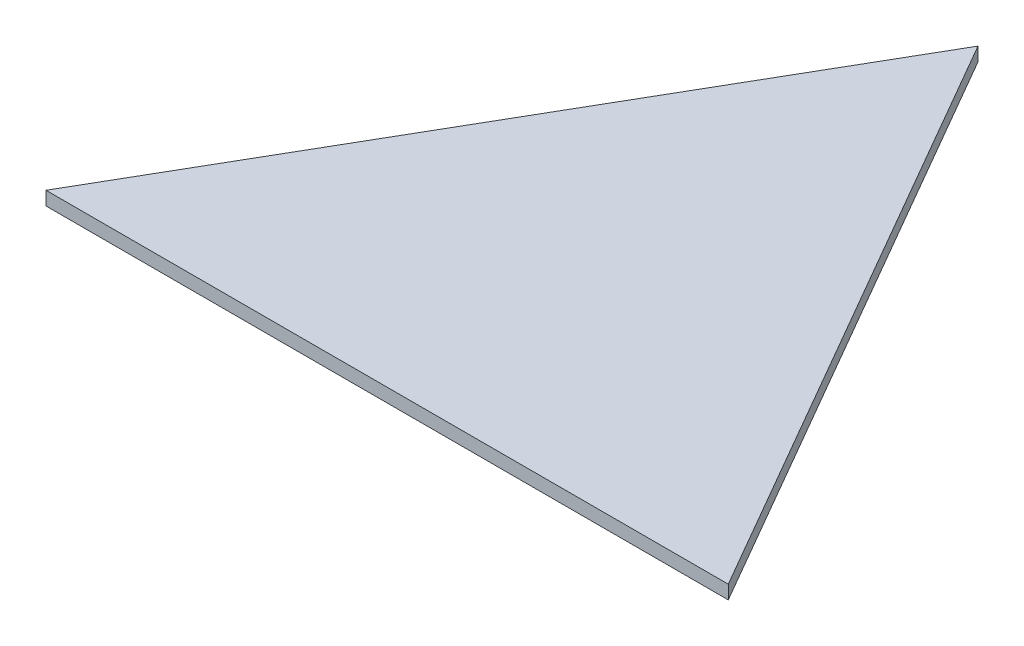
ISO-10303-21;
HEADER;
FILE_DESCRIPTION(('STEP AP214'),'2;1');
FILE_NAME('part.step','',(''),(''),'','','');
FILE_SCHEMA(('AUTOMOTIVE_DESIGN { 1 0 10303 214 1 1 1 1 }'));
ENDSEC;
DATA;
#1=APPLICATION_CONTEXT('core data for automotive mechanical design processes');
#2=APPLICATION_PROTOCOL_DEFINITION('international standard','automotive_design',2000,#1);
#3=PRODUCT_CONTEXT('',#1,'mechanical');
#4=PRODUCT('Part','Part','',(#3));
#5=PRODUCT_RELATED_PRODUCT_CATEGORY('part','',(#4));
#6=PRODUCT_DEFINITION_FORMATION('','',#4);
#7=PRODUCT_DEFINITION_CONTEXT('part definition',#1,'design');
#8=PRODUCT_DEFINITION('design','',#6,#7);
#9=PRODUCT_DEFINITION_SHAPE('','',#8);
#10=(LENGTH_UNIT() NAMED_UNIT(*) SI_UNIT(.MILLI.,.METRE.));
#11=(NAMED_UNIT(*) PLANE_ANGLE_UNIT() SI_UNIT($,.RADIAN.));
#12=(NAMED_UNIT(*) SI_UNIT($,.STERADIAN.) SOLID_ANGLE_UNIT());
#13=UNCERTAINTY_MEASURE_WITH_UNIT(LENGTH_MEASURE(1.E-05),#10,'distance_accuracy_value','');
#14=(GEOMETRIC_REPRESENTATION_CONTEXT(3) GLOBAL_UNCERTAINTY_ASSIGNED_CONTEXT((#13)) GLOBAL_UNIT_ASSIGNED_CONTEXT((#10,
#11,#12)) REPRESENTATION_CONTEXT('',''));
#15=CARTESIAN_POINT('',(0.,0.,0.));
#16=DIRECTION('',(0.,0.,1.));
#17=DIRECTION('',(1.,0.,0.));
#18=AXIS2_PLACEMENT_3D('',#15,#16,#17);
#19=CARTESIAN_POINT('',(-75.,3.,54.9038105676658));
#20=DIRECTION('',(0.,0.,-1.));
#21=DIRECTION('',(-1.,0.,0.));
#22=AXIS2_PLACEMENT_3D('',#19,#20,#21);
#23=PLANE('',#22);
#24=DIRECTION('',(1.,0.,0.));
#25=VECTOR('',#24,1.);
#26=CARTESIAN_POINT('',(-75.,0.,54.9038105676658));
#27=LINE('',#26,#25);
#28=CARTESIAN_POINT('',(-75.,0.,54.9038105676658));
#29=VERTEX_POINT('',#28);
#30=CARTESIAN_POINT('',(75.,0.,54.9038105676658));
#31=VERTEX_POINT('',#30);
#32=EDGE_CURVE('E85',#29,#31,#27,.T.);
#33=ORIENTED_EDGE('',*,*,#32,.T.);
#34=DIRECTION('',(0.,-1.,0.));
#35=VECTOR('',#34,1.);
#36=CARTESIAN_POINT('',(75.,3.,54.9038105676658));
#37=LINE('',#36,#35);
#38=CARTESIAN_POINT('',(75.,3.,54.9038105676658));
#39=VERTEX_POINT('',#38);
#40=EDGE_CURVE('E11',#39,#31,#37,.T.);
#41=ORIENTED_EDGE('',*,*,#40,.F.);
#42=DIRECTION('',(1.,0.,0.));
#43=VECTOR('',#42,1.);
#44=CARTESIAN_POINT('',(-75.,3.,54.9038105676658));
#45=LINE('',#44,#43);
#46=CARTESIAN_POINT('',(-75.,3.,54.9038105676658));
#47=VERTEX_POINT('',#46);
#48=EDGE_CURVE('E80',#47,#39,#45,.T.);
#49=ORIENTED_EDGE('',*,*,#48,.F.);
#50=DIRECTION('',(0.,-1.,0.));
#51=VECTOR('',#50,1.);
#52=CARTESIAN_POINT('',(-75.,3.,54.9038105676658));
#53=LINE('',#52,#51);
#54=EDGE_CURVE('E55',#47,#29,#53,.T.);
#55=ORIENTED_EDGE('',*,*,#54,.T.);
#56=EDGE_LOOP('',(#33,#41,#49,#55));
#57=FACE_BOUND('',#56,.T.);
#58=ADVANCED_FACE('F39',(#57),#23,.F.);
#59=CARTESIAN_POINT('',(75.,3.,54.9038105676658));
#60=DIRECTION('',(-0.866025403784439,0.,0.5));
#61=DIRECTION('',(0.5,0.,0.866025403784439));
#62=AXIS2_PLACEMENT_3D('',#59,#60,#61);
#63=PLANE('',#62);
#64=DIRECTION('',(-0.5,0.,-0.866025403784439));
#65=VECTOR('',#64,1.);
#66=CARTESIAN_POINT('',(75.,0.,54.9038105676658));
#67=LINE('',#66,#65);
#68=CARTESIAN_POINT('',(0.,0.,-75.));
#69=VERTEX_POINT('',#68);
#70=EDGE_CURVE('E88',#31,#69,#67,.T.);
#71=ORIENTED_EDGE('',*,*,#70,.T.);
#72=DIRECTION('',(0.,-1.,0.));
#73=VECTOR('',#72,1.);
#74=CARTESIAN_POINT('',(0.,3.,-75.));
#75=LINE('',#74,#73);
#76=CARTESIAN_POINT('',(0.,3.,-75.));
#77=VERTEX_POINT('',#76);
#78=EDGE_CURVE('E47',#77,#69,#75,.T.);
#79=ORIENTED_EDGE('',*,*,#78,.F.);
#80=DIRECTION('',(-0.5,0.,-0.866025403784439));
#81=VECTOR('',#80,1.);
#82=CARTESIAN_POINT('',(75.,3.,54.9038105676658));
#83=LINE('',#82,#81);
#84=EDGE_CURVE('E73',#39,#77,#83,.T.);
#85=ORIENTED_EDGE('',*,*,#84,.F.);
#86=ORIENTED_EDGE('',*,*,#40,.T.);
#87=EDGE_LOOP('',(#71,#79,#85,#86));
#88=FACE_BOUND('',#87,.T.);
#89=ADVANCED_FACE('F75',(#88),#63,.F.);
#90=CARTESIAN_POINT('',(-75.,3.,54.9038105676658));
#91=DIRECTION('',(-0.866025403784439,0.,-0.5));
#92=DIRECTION('',(-0.5,0.,0.866025403784439));
#93=AXIS2_PLACEMENT_3D('',#90,#91,#92);
#94=PLANE('',#93);
#95=DIRECTION('',(0.5,0.,-0.866025403784439));
#96=VECTOR('',#95,1.);
#97=CARTESIAN_POINT('',(-75.,0.,54.9038105676658));
#98=LINE('',#97,#96);
#99=EDGE_CURVE('E83',#29,#69,#98,.T.);
#100=ORIENTED_EDGE('',*,*,#99,.F.);
#101=ORIENTED_EDGE('',*,*,#54,.F.);
#102=DIRECTION('',(0.5,0.,-0.866025403784439));
#103=VECTOR('',#102,1.);
#104=CARTESIAN_POINT('',(-75.,3.,54.9038105676658));
#105=LINE('',#104,#103);
#106=EDGE_CURVE('E79',#47,#77,#105,.T.);
#107=ORIENTED_EDGE('',*,*,#106,.T.);
#108=ORIENTED_EDGE('',*,*,#78,.T.);
#109=EDGE_LOOP('',(#100,#101,#107,#108));
#110=FACE_BOUND('',#109,.T.);
#111=ADVANCED_FACE('F94',(#110),#94,.T.);
#112=CARTESIAN_POINT('',(0.,3.,0.));
#113=DIRECTION('',(0.,1.,0.));
#114=DIRECTION('',(0.,0.,1.));
#115=AXIS2_PLACEMENT_3D('',#112,#113,#114);
#116=PLANE('',#115);
#117=ORIENTED_EDGE('',*,*,#48,.T.);
#118=ORIENTED_EDGE('',*,*,#84,.T.);
#119=ORIENTED_EDGE('',*,*,#106,.F.);
#120=EDGE_LOOP('',(#117,#118,#119));
#121=FACE_BOUND('',#120,.T.);
#122=ADVANCED_FACE('F82',(#121),#116,.T.);
#123=CARTESIAN_POINT('',(0.,0.,0.));
#124=DIRECTION('',(0.,1.,0.));
#125=DIRECTION('',(0.,0.,1.));
#126=AXIS2_PLACEMENT_3D('',#123,#124,#125);
#127=PLANE('',#126);
#128=ORIENTED_EDGE('',*,*,#32,.F.);
#129=ORIENTED_EDGE('',*,*,#99,.T.);
#130=ORIENTED_EDGE('',*,*,#70,.F.);
#131=EDGE_LOOP('',(#128,#129,#130));
#132=FACE_BOUND('',#131,.T.);
#133=ADVANCED_FACE('F101',(#132),#127,.F.);
#134=CLOSED_SHELL('',(#58,#89,#111,#122,#133));
#135=MANIFOLD_SOLID_BREP('B2',#134);
#136=ADVANCED_BREP_SHAPE_REPRESENTATION('',(#18,#135),#14);
#137=SHAPE_DEFINITION_REPRESENTATION(#9,#136);
ENDSEC;
END-ISO-10303-21;
